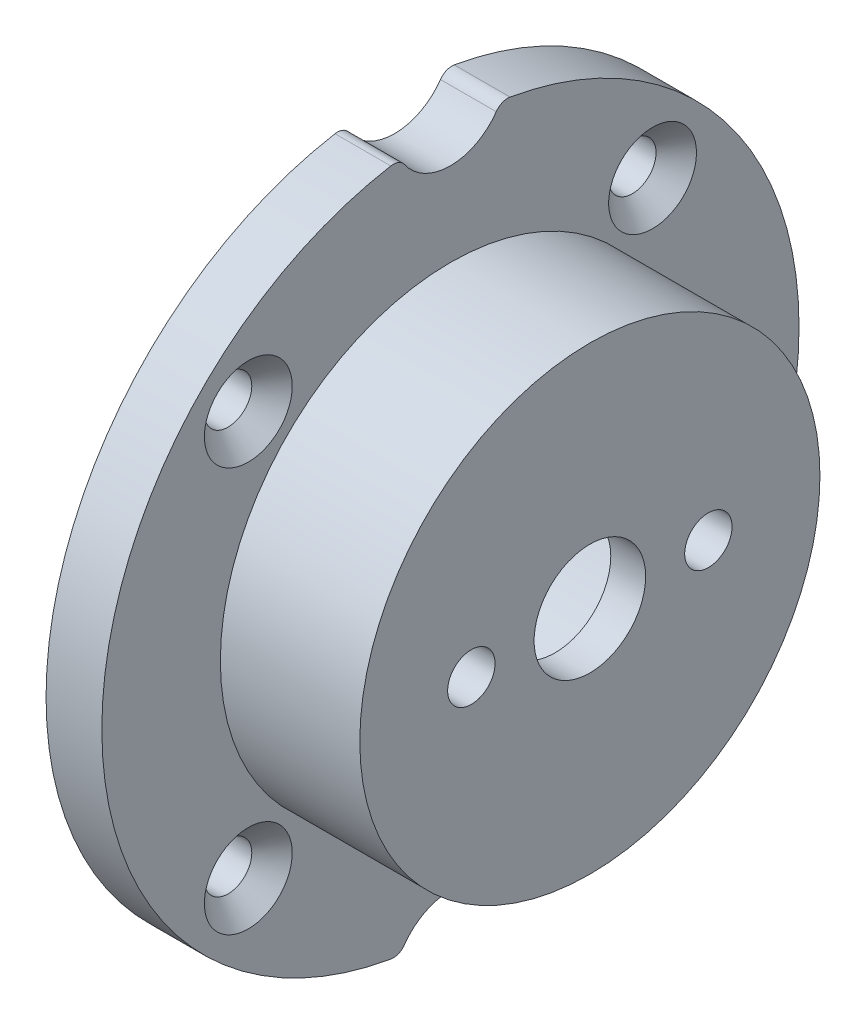
ISO-10303-21;
HEADER;
FILE_DESCRIPTION(('STEP AP214'),'2;1');
FILE_NAME('part.step','',(''),(''),'','','');
FILE_SCHEMA(('AUTOMOTIVE_DESIGN { 1 0 10303 214 1 1 1 1 }'));
ENDSEC;
DATA;
#1=APPLICATION_CONTEXT('core data for automotive mechanical design processes');
#2=APPLICATION_PROTOCOL_DEFINITION('international standard','automotive_design',2000,#1);
#3=PRODUCT_CONTEXT('',#1,'mechanical');
#4=PRODUCT('Part','Part','',(#3));
#5=PRODUCT_RELATED_PRODUCT_CATEGORY('part','',(#4));
#6=PRODUCT_DEFINITION_FORMATION('','',#4);
#7=PRODUCT_DEFINITION_CONTEXT('part definition',#1,'design');
#8=PRODUCT_DEFINITION('design','',#6,#7);
#9=PRODUCT_DEFINITION_SHAPE('','',#8);
#10=(LENGTH_UNIT() NAMED_UNIT(*) SI_UNIT(.MILLI.,.METRE.));
#11=(NAMED_UNIT(*) PLANE_ANGLE_UNIT() SI_UNIT($,.RADIAN.));
#12=(NAMED_UNIT(*) SI_UNIT($,.STERADIAN.) SOLID_ANGLE_UNIT());
#13=UNCERTAINTY_MEASURE_WITH_UNIT(LENGTH_MEASURE(1.E-05),#10,'distance_accuracy_value','');
#14=(GEOMETRIC_REPRESENTATION_CONTEXT(3) GLOBAL_UNCERTAINTY_ASSIGNED_CONTEXT((#13)) GLOBAL_UNIT_ASSIGNED_CONTEXT((#10,
#11,#12)) REPRESENTATION_CONTEXT('',''));
#15=CARTESIAN_POINT('',(0.,0.,0.));
#16=DIRECTION('',(0.,0.,1.));
#17=DIRECTION('',(1.,0.,0.));
#18=AXIS2_PLACEMENT_3D('',#15,#16,#17);
#19=CARTESIAN_POINT('',(4.,0.,0.));
#20=DIRECTION('',(-1.,0.,0.));
#21=DIRECTION('',(0.,0.,1.));
#22=AXIS2_PLACEMENT_3D('',#19,#20,#21);
#23=CYLINDRICAL_SURFACE('',#22,25.);
#24=CARTESIAN_POINT('',(0.,0.,0.));
#25=DIRECTION('',(1.,0.,0.));
#26=DIRECTION('',(0.,0.,-1.));
#27=AXIS2_PLACEMENT_3D('',#24,#25,#26);
#28=CIRCLE('',#27,25.);
#29=CARTESIAN_POINT('',(0.,24.6314858490566,4.27666983384552));
#30=VERTEX_POINT('',#29);
#31=CARTESIAN_POINT('',(0.,-24.6314858490566,4.27666983384552));
#32=VERTEX_POINT('',#31);
#33=EDGE_CURVE('E114',#30,#32,#28,.T.);
#34=ORIENTED_EDGE('',*,*,#33,.T.);
#35=DIRECTION('',(-1.,0.,0.));
#36=VECTOR('',#35,1.);
#37=CARTESIAN_POINT('',(4.,-24.6314858490566,4.27666983384552));
#38=LINE('',#37,#36);
#39=CARTESIAN_POINT('',(4.,-24.6314858490566,4.27666983384552));
#40=VERTEX_POINT('',#39);
#41=EDGE_CURVE('E118',#32,#40,#38,.F.);
#42=ORIENTED_EDGE('',*,*,#41,.T.);
#43=CARTESIAN_POINT('',(4.,0.,0.));
#44=DIRECTION('',(1.,0.,0.));
#45=DIRECTION('',(0.,0.,-1.));
#46=AXIS2_PLACEMENT_3D('',#43,#44,#45);
#47=CIRCLE('',#46,25.);
#48=CARTESIAN_POINT('',(4.,24.6314858490566,4.27666983384552));
#49=VERTEX_POINT('',#48);
#50=EDGE_CURVE('E117',#49,#40,#47,.T.);
#51=ORIENTED_EDGE('',*,*,#50,.F.);
#52=DIRECTION('',(-1.,0.,0.));
#53=VECTOR('',#52,1.);
#54=CARTESIAN_POINT('',(4.,24.6314858490566,4.27666983384552));
#55=LINE('',#54,#53);
#56=EDGE_CURVE('E106',#49,#30,#55,.T.);
#57=ORIENTED_EDGE('',*,*,#56,.T.);
#58=EDGE_LOOP('',(#34,#42,#51,#57));
#59=FACE_BOUND('',#58,.T.);
#60=ADVANCED_FACE('F39',(#59),#23,.T.);
#61=CARTESIAN_POINT('',(4.,0.,0.));
#62=DIRECTION('',(1.,0.,0.));
#63=DIRECTION('',(0.,0.,-1.));
#64=AXIS2_PLACEMENT_3D('',#61,#62,#63);
#65=PLANE('',#64);
#66=ORIENTED_EDGE('',*,*,#50,.T.);
#67=CARTESIAN_POINT('',(4.,-23.6462264150943,4.1056030404917));
#68=DIRECTION('',(1.,0.,0.));
#69=DIRECTION('',(0.,0.,-1.));
#70=AXIS2_PLACEMENT_3D('',#67,#68,#69);
#71=CIRCLE('',#70,1.);
#72=CARTESIAN_POINT('',(4.,-24.2169811320755,3.28448243239336));
#73=VERTEX_POINT('',#72);
#74=EDGE_CURVE('E157',#40,#73,#71,.T.);
#75=ORIENTED_EDGE('',*,*,#74,.T.);
#76=CARTESIAN_POINT('',(4.,-26.5,0.));
#77=DIRECTION('',(1.,0.,0.));
#78=DIRECTION('',(0.,0.,1.));
#79=AXIS2_PLACEMENT_3D('',#76,#77,#78);
#80=CIRCLE('',#79,4.);
#81=CARTESIAN_POINT('',(4.,-24.2169811320755,-3.28448243239336));
#82=VERTEX_POINT('',#81);
#83=EDGE_CURVE('E188',#82,#73,#80,.T.);
#84=ORIENTED_EDGE('',*,*,#83,.F.);
#85=CARTESIAN_POINT('',(4.,-23.6462264150943,-4.1056030404917));
#86=DIRECTION('',(1.,0.,0.));
#87=DIRECTION('',(0.,0.,-1.));
#88=AXIS2_PLACEMENT_3D('',#85,#86,#87);
#89=CIRCLE('',#88,1.);
#90=CARTESIAN_POINT('',(4.,-24.6314858490566,-4.27666983384552));
#91=VERTEX_POINT('',#90);
#92=EDGE_CURVE('E155',#82,#91,#89,.T.);
#93=ORIENTED_EDGE('',*,*,#92,.T.);
#94=CARTESIAN_POINT('',(4.,24.6314858490566,-4.27666983384552));
#95=VERTEX_POINT('',#94);
#96=EDGE_CURVE('E125',#91,#95,#47,.T.);
#97=ORIENTED_EDGE('',*,*,#96,.T.);
#98=CARTESIAN_POINT('',(4.,23.6462264150943,-4.1056030404917));
#99=DIRECTION('',(1.,0.,0.));
#100=DIRECTION('',(0.,0.,-1.));
#101=AXIS2_PLACEMENT_3D('',#98,#99,#100);
#102=CIRCLE('',#101,1.);
#103=CARTESIAN_POINT('',(4.,24.2169811320755,-3.28448243239336));
#104=VERTEX_POINT('',#103);
#105=EDGE_CURVE('E151',#95,#104,#102,.T.);
#106=ORIENTED_EDGE('',*,*,#105,.T.);
#107=CARTESIAN_POINT('',(4.,26.5,0.));
#108=DIRECTION('',(1.,0.,0.));
#109=DIRECTION('',(0.,0.,-1.));
#110=AXIS2_PLACEMENT_3D('',#107,#108,#109);
#111=CIRCLE('',#110,4.);
#112=CARTESIAN_POINT('',(4.,24.2169811320755,3.28448243239336));
#113=VERTEX_POINT('',#112);
#114=EDGE_CURVE('E196',#113,#104,#111,.T.);
#115=ORIENTED_EDGE('',*,*,#114,.F.);
#116=CARTESIAN_POINT('',(4.,23.6462264150943,4.1056030404917));
#117=DIRECTION('',(1.,0.,0.));
#118=DIRECTION('',(0.,0.,-1.));
#119=AXIS2_PLACEMENT_3D('',#116,#117,#118);
#120=CIRCLE('',#119,1.);
#121=EDGE_CURVE('E153',#113,#49,#120,.T.);
#122=ORIENTED_EDGE('',*,*,#121,.T.);
#123=EDGE_LOOP('',(#66,#75,#84,#93,#97,#106,#115,#122));
#124=FACE_BOUND('',#123,.T.);
#125=CARTESIAN_POINT('',(4.,14.4956890143241,14.4956890143244));
#126=DIRECTION('',(1.,0.,0.));
#127=DIRECTION('',(0.,0.,-1.));
#128=AXIS2_PLACEMENT_3D('',#125,#126,#127);
#129=CIRCLE('',#128,3.15);
#130=CARTESIAN_POINT('',(4.,14.4956890143241,11.3456890143244));
#131=VERTEX_POINT('',#130);
#132=EDGE_CURVE('E206',#131,#131,#129,.T.);
#133=ORIENTED_EDGE('',*,*,#132,.F.);
#134=EDGE_LOOP('',(#133));
#135=FACE_BOUND('',#134,.T.);
#136=CARTESIAN_POINT('',(4.,14.4956890143242,-14.4956890143242));
#137=DIRECTION('',(1.,0.,0.));
#138=DIRECTION('',(0.,0.,-1.));
#139=AXIS2_PLACEMENT_3D('',#136,#137,#138);
#140=CIRCLE('',#139,3.15);
#141=CARTESIAN_POINT('',(4.,14.4956890143242,-17.6456890143242));
#142=VERTEX_POINT('',#141);
#143=EDGE_CURVE('E215',#142,#142,#140,.T.);
#144=ORIENTED_EDGE('',*,*,#143,.F.);
#145=EDGE_LOOP('',(#144));
#146=FACE_BOUND('',#145,.T.);
#147=CARTESIAN_POINT('',(4.,-14.4956890143242,-14.4956890143243));
#148=DIRECTION('',(1.,0.,0.));
#149=DIRECTION('',(0.,0.,-1.));
#150=AXIS2_PLACEMENT_3D('',#147,#148,#149);
#151=CIRCLE('',#150,3.15);
#152=CARTESIAN_POINT('',(4.,-14.4956890143242,-17.6456890143243));
#153=VERTEX_POINT('',#152);
#154=EDGE_CURVE('E224',#153,#153,#151,.T.);
#155=ORIENTED_EDGE('',*,*,#154,.F.);
#156=EDGE_LOOP('',(#155));
#157=FACE_BOUND('',#156,.T.);
#158=CARTESIAN_POINT('',(4.,-14.4956890143242,14.4956890143242));
#159=DIRECTION('',(1.,0.,0.));
#160=DIRECTION('',(0.,0.,-1.));
#161=AXIS2_PLACEMENT_3D('',#158,#159,#160);
#162=CIRCLE('',#161,3.15);
#163=CARTESIAN_POINT('',(4.,-14.4956890143242,11.3456890143242));
#164=VERTEX_POINT('',#163);
#165=EDGE_CURVE('E233',#164,#164,#162,.T.);
#166=ORIENTED_EDGE('',*,*,#165,.F.);
#167=EDGE_LOOP('',(#166));
#168=FACE_BOUND('',#167,.T.);
#169=CARTESIAN_POINT('',(4.,0.,0.));
#170=DIRECTION('',(1.,0.,0.));
#171=DIRECTION('',(0.,0.,-1.));
#172=AXIS2_PLACEMENT_3D('',#169,#170,#171);
#173=CIRCLE('',#172,16.5);
#174=CARTESIAN_POINT('',(4.,0.,-16.5));
#175=VERTEX_POINT('',#174);
#176=EDGE_CURVE('E137',#175,#175,#173,.T.);
#177=ORIENTED_EDGE('',*,*,#176,.F.);
#178=EDGE_LOOP('',(#177));
#179=FACE_BOUND('',#178,.T.);
#180=ADVANCED_FACE('F183',(#124,#135,#146,#157,#168,#179),#65,.T.);
#181=ORIENTED_EDGE('',*,*,#96,.F.);
#182=DIRECTION('',(-1.,0.,0.));
#183=VECTOR('',#182,1.);
#184=CARTESIAN_POINT('',(4.,-24.6314858490566,-4.27666983384552));
#185=LINE('',#184,#183);
#186=CARTESIAN_POINT('',(0.,-24.6314858490566,-4.27666983384552));
#187=VERTEX_POINT('',#186);
#188=EDGE_CURVE('E169',#91,#187,#185,.T.);
#189=ORIENTED_EDGE('',*,*,#188,.T.);
#190=CARTESIAN_POINT('',(0.,24.6314858490566,-4.27666983384552));
#191=VERTEX_POINT('',#190);
#192=EDGE_CURVE('E126',#187,#191,#28,.T.);
#193=ORIENTED_EDGE('',*,*,#192,.T.);
#194=DIRECTION('',(-1.,0.,0.));
#195=VECTOR('',#194,1.);
#196=CARTESIAN_POINT('',(4.,24.6314858490566,-4.27666983384552));
#197=LINE('',#196,#195);
#198=EDGE_CURVE('E166',#191,#95,#197,.F.);
#199=ORIENTED_EDGE('',*,*,#198,.T.);
#200=EDGE_LOOP('',(#181,#189,#193,#199));
#201=FACE_BOUND('',#200,.T.);
#202=ADVANCED_FACE('F175',(#201),#23,.T.);
#203=CARTESIAN_POINT('',(0.,0.,0.));
#204=DIRECTION('',(1.,0.,0.));
#205=DIRECTION('',(0.,0.,-1.));
#206=AXIS2_PLACEMENT_3D('',#203,#204,#205);
#207=PLANE('',#206);
#208=CARTESIAN_POINT('',(0.,0.,0.));
#209=DIRECTION('',(-1.,0.,0.));
#210=DIRECTION('',(0.,0.,1.));
#211=AXIS2_PLACEMENT_3D('',#208,#209,#210);
#212=CIRCLE('',#211,13.125);
#213=CARTESIAN_POINT('',(0.,0.,13.125));
#214=VERTEX_POINT('',#213);
#215=EDGE_CURVE('E197',#214,#214,#212,.T.);
#216=ORIENTED_EDGE('',*,*,#215,.F.);
#217=EDGE_LOOP('',(#216));
#218=FACE_BOUND('',#217,.T.);
#219=CARTESIAN_POINT('',(0.,14.4956890143241,14.4956890143244));
#220=DIRECTION('',(1.,0.,0.));
#221=DIRECTION('',(0.,0.,-1.));
#222=AXIS2_PLACEMENT_3D('',#219,#220,#221);
#223=CIRCLE('',#222,1.7);
#224=CARTESIAN_POINT('',(0.,14.4956890143241,12.7956890143244));
#225=VERTEX_POINT('',#224);
#226=EDGE_CURVE('E212',#225,#225,#223,.T.);
#227=ORIENTED_EDGE('',*,*,#226,.T.);
#228=EDGE_LOOP('',(#227));
#229=FACE_BOUND('',#228,.T.);
#230=CARTESIAN_POINT('',(0.,14.4956890143242,-14.4956890143242));
#231=DIRECTION('',(1.,0.,0.));
#232=DIRECTION('',(0.,0.,-1.));
#233=AXIS2_PLACEMENT_3D('',#230,#231,#232);
#234=CIRCLE('',#233,1.7);
#235=CARTESIAN_POINT('',(0.,14.4956890143242,-16.1956890143242));
#236=VERTEX_POINT('',#235);
#237=EDGE_CURVE('E221',#236,#236,#234,.T.);
#238=ORIENTED_EDGE('',*,*,#237,.T.);
#239=EDGE_LOOP('',(#238));
#240=FACE_BOUND('',#239,.T.);
#241=CARTESIAN_POINT('',(0.,-14.4956890143242,-14.4956890143243));
#242=DIRECTION('',(1.,0.,0.));
#243=DIRECTION('',(0.,0.,-1.));
#244=AXIS2_PLACEMENT_3D('',#241,#242,#243);
#245=CIRCLE('',#244,1.7);
#246=CARTESIAN_POINT('',(0.,-14.4956890143242,-16.1956890143243));
#247=VERTEX_POINT('',#246);
#248=EDGE_CURVE('E230',#247,#247,#245,.T.);
#249=ORIENTED_EDGE('',*,*,#248,.T.);
#250=EDGE_LOOP('',(#249));
#251=FACE_BOUND('',#250,.T.);
#252=CARTESIAN_POINT('',(0.,-14.4956890143242,14.4956890143242));
#253=DIRECTION('',(1.,0.,0.));
#254=DIRECTION('',(0.,0.,-1.));
#255=AXIS2_PLACEMENT_3D('',#252,#253,#254);
#256=CIRCLE('',#255,1.7);
#257=CARTESIAN_POINT('',(0.,-14.4956890143242,12.7956890143242));
#258=VERTEX_POINT('',#257);
#259=EDGE_CURVE('E239',#258,#258,#256,.T.);
#260=ORIENTED_EDGE('',*,*,#259,.T.);
#261=EDGE_LOOP('',(#260));
#262=FACE_BOUND('',#261,.T.);
#263=CARTESIAN_POINT('',(0.,-26.5,0.));
#264=DIRECTION('',(1.,0.,0.));
#265=DIRECTION('',(0.,0.,-1.));
#266=AXIS2_PLACEMENT_3D('',#263,#264,#265);
#267=CIRCLE('',#266,4.);
#268=CARTESIAN_POINT('',(0.,-24.2169811320755,-3.28448243239336));
#269=VERTEX_POINT('',#268);
#270=CARTESIAN_POINT('',(0.,-24.2169811320755,3.28448243239336));
#271=VERTEX_POINT('',#270);
#272=EDGE_CURVE('E119',#269,#271,#267,.T.);
#273=ORIENTED_EDGE('',*,*,#272,.T.);
#274=CARTESIAN_POINT('',(0.,-23.6462264150943,4.1056030404917));
#275=DIRECTION('',(1.,0.,0.));
#276=DIRECTION('',(0.,0.,-1.));
#277=AXIS2_PLACEMENT_3D('',#274,#275,#276);
#278=CIRCLE('',#277,1.);
#279=EDGE_CURVE('E124',#271,#32,#278,.F.);
#280=ORIENTED_EDGE('',*,*,#279,.T.);
#281=ORIENTED_EDGE('',*,*,#33,.F.);
#282=CARTESIAN_POINT('',(0.,23.6462264150943,4.1056030404917));
#283=DIRECTION('',(1.,0.,0.));
#284=DIRECTION('',(0.,0.,-1.));
#285=AXIS2_PLACEMENT_3D('',#282,#283,#284);
#286=CIRCLE('',#285,1.);
#287=CARTESIAN_POINT('',(0.,24.2169811320755,3.28448243239336));
#288=VERTEX_POINT('',#287);
#289=EDGE_CURVE('E60',#30,#288,#286,.F.);
#290=ORIENTED_EDGE('',*,*,#289,.T.);
#291=CARTESIAN_POINT('',(0.,26.5,0.));
#292=DIRECTION('',(1.,0.,0.));
#293=DIRECTION('',(0.,0.,-1.));
#294=AXIS2_PLACEMENT_3D('',#291,#292,#293);
#295=CIRCLE('',#294,4.);
#296=CARTESIAN_POINT('',(0.,24.2169811320755,-3.28448243239336));
#297=VERTEX_POINT('',#296);
#298=EDGE_CURVE('E147',#288,#297,#295,.T.);
#299=ORIENTED_EDGE('',*,*,#298,.T.);
#300=CARTESIAN_POINT('',(0.,23.6462264150943,-4.1056030404917));
#301=DIRECTION('',(1.,0.,0.));
#302=DIRECTION('',(0.,0.,-1.));
#303=AXIS2_PLACEMENT_3D('',#300,#301,#302);
#304=CIRCLE('',#303,1.);
#305=EDGE_CURVE('E108',#297,#191,#304,.F.);
#306=ORIENTED_EDGE('',*,*,#305,.T.);
#307=ORIENTED_EDGE('',*,*,#192,.F.);
#308=CARTESIAN_POINT('',(0.,-23.6462264150943,-4.1056030404917));
#309=DIRECTION('',(1.,0.,0.));
#310=DIRECTION('',(0.,0.,-1.));
#311=AXIS2_PLACEMENT_3D('',#308,#309,#310);
#312=CIRCLE('',#311,1.);
#313=EDGE_CURVE('E107',#187,#269,#312,.F.);
#314=ORIENTED_EDGE('',*,*,#313,.T.);
#315=EDGE_LOOP('',(#273,#280,#281,#290,#299,#306,#307,#314));
#316=FACE_BOUND('',#315,.T.);
#317=ADVANCED_FACE('F122',(#218,#229,#240,#251,#262,#316),#207,.F.);
#318=CARTESIAN_POINT('',(14.,0.,0.));
#319=DIRECTION('',(-1.,0.,0.));
#320=DIRECTION('',(0.,0.,1.));
#321=AXIS2_PLACEMENT_3D('',#318,#319,#320);
#322=CYLINDRICAL_SURFACE('',#321,16.5);
#323=CARTESIAN_POINT('',(14.,0.,0.));
#324=DIRECTION('',(1.,0.,0.));
#325=DIRECTION('',(0.,0.,-1.));
#326=AXIS2_PLACEMENT_3D('',#323,#324,#325);
#327=CIRCLE('',#326,16.5);
#328=CARTESIAN_POINT('',(14.,0.,-16.5));
#329=VERTEX_POINT('',#328);
#330=EDGE_CURVE('E131',#329,#329,#327,.T.);
#331=ORIENTED_EDGE('',*,*,#330,.F.);
#332=EDGE_LOOP('',(#331));
#333=FACE_BOUND('',#332,.T.);
#334=ORIENTED_EDGE('',*,*,#176,.T.);
#335=EDGE_LOOP('',(#334));
#336=FACE_BOUND('',#335,.T.);
#337=ADVANCED_FACE('F252',(#333,#336),#322,.T.);
#338=CARTESIAN_POINT('',(14.,0.,0.));
#339=DIRECTION('',(1.,0.,0.));
#340=DIRECTION('',(0.,0.,-1.));
#341=AXIS2_PLACEMENT_3D('',#338,#339,#340);
#342=PLANE('',#341);
#343=CARTESIAN_POINT('',(14.,0.,-8.5));
#344=DIRECTION('',(1.,0.,0.));
#345=DIRECTION('',(0.,0.,-1.));
#346=AXIS2_PLACEMENT_3D('',#343,#344,#345);
#347=CIRCLE('',#346,1.69999999999999);
#348=CARTESIAN_POINT('',(14.,0.,-10.2));
#349=VERTEX_POINT('',#348);
#350=EDGE_CURVE('E146',#349,#349,#347,.T.);
#351=ORIENTED_EDGE('',*,*,#350,.F.);
#352=EDGE_LOOP('',(#351));
#353=FACE_BOUND('',#352,.T.);
#354=CARTESIAN_POINT('',(14.,0.,8.5));
#355=DIRECTION('',(1.,0.,0.));
#356=DIRECTION('',(0.,0.,-1.));
#357=AXIS2_PLACEMENT_3D('',#354,#355,#356);
#358=CIRCLE('',#357,1.69999999999999);
#359=CARTESIAN_POINT('',(14.,0.,6.80000000000001));
#360=VERTEX_POINT('',#359);
#361=EDGE_CURVE('E142',#360,#360,#358,.T.);
#362=ORIENTED_EDGE('',*,*,#361,.F.);
#363=EDGE_LOOP('',(#362));
#364=FACE_BOUND('',#363,.T.);
#365=CARTESIAN_POINT('',(14.,0.,0.));
#366=DIRECTION('',(1.,0.,0.));
#367=DIRECTION('',(0.,0.,-1.));
#368=AXIS2_PLACEMENT_3D('',#365,#366,#367);
#369=CIRCLE('',#368,4.);
#370=CARTESIAN_POINT('',(14.,0.,-4.));
#371=VERTEX_POINT('',#370);
#372=EDGE_CURVE('E138',#371,#371,#369,.T.);
#373=ORIENTED_EDGE('',*,*,#372,.F.);
#374=EDGE_LOOP('',(#373));
#375=FACE_BOUND('',#374,.T.);
#376=ORIENTED_EDGE('',*,*,#330,.T.);
#377=EDGE_LOOP('',(#376));
#378=FACE_BOUND('',#377,.T.);
#379=ADVANCED_FACE('F356',(#353,#364,#375,#378),#342,.T.);
#380=CARTESIAN_POINT('',(11.5,0.,0.));
#381=DIRECTION('',(1.,0.,0.));
#382=DIRECTION('',(0.,0.,-1.));
#383=AXIS2_PLACEMENT_3D('',#380,#381,#382);
#384=PLANE('',#383);
#385=CARTESIAN_POINT('',(11.5,0.,-8.5));
#386=DIRECTION('',(1.,0.,0.));
#387=DIRECTION('',(0.,0.,-1.));
#388=AXIS2_PLACEMENT_3D('',#385,#386,#387);
#389=CIRCLE('',#388,1.69999999999999);
#390=CARTESIAN_POINT('',(11.5,0.,-10.2));
#391=VERTEX_POINT('',#390);
#392=EDGE_CURVE('E143',#391,#391,#389,.T.);
#393=ORIENTED_EDGE('',*,*,#392,.T.);
#394=EDGE_LOOP('',(#393));
#395=FACE_BOUND('',#394,.T.);
#396=CARTESIAN_POINT('',(11.5,0.,8.5));
#397=DIRECTION('',(1.,0.,0.));
#398=DIRECTION('',(0.,0.,-1.));
#399=AXIS2_PLACEMENT_3D('',#396,#397,#398);
#400=CIRCLE('',#399,1.69999999999999);
#401=CARTESIAN_POINT('',(11.5,0.,6.80000000000001));
#402=VERTEX_POINT('',#401);
#403=EDGE_CURVE('E139',#402,#402,#400,.T.);
#404=ORIENTED_EDGE('',*,*,#403,.T.);
#405=EDGE_LOOP('',(#404));
#406=FACE_BOUND('',#405,.T.);
#407=CARTESIAN_POINT('',(11.5,0.,0.));
#408=DIRECTION('',(1.,0.,0.));
#409=DIRECTION('',(0.,0.,-1.));
#410=AXIS2_PLACEMENT_3D('',#407,#408,#409);
#411=CIRCLE('',#410,4.);
#412=CARTESIAN_POINT('',(11.5,0.,-4.));
#413=VERTEX_POINT('',#412);
#414=EDGE_CURVE('E134',#413,#413,#411,.T.);
#415=ORIENTED_EDGE('',*,*,#414,.T.);
#416=EDGE_LOOP('',(#415));
#417=FACE_BOUND('',#416,.T.);
#418=CARTESIAN_POINT('',(11.5,0.,0.));
#419=DIRECTION('',(1.,0.,0.));
#420=DIRECTION('',(0.,0.,-1.));
#421=AXIS2_PLACEMENT_3D('',#418,#419,#420);
#422=CIRCLE('',#421,13.125);
#423=CARTESIAN_POINT('',(11.5,0.,-13.125));
#424=VERTEX_POINT('',#423);
#425=EDGE_CURVE('E200',#424,#424,#422,.F.);
#426=ORIENTED_EDGE('',*,*,#425,.T.);
#427=EDGE_LOOP('',(#426));
#428=FACE_BOUND('',#427,.T.);
#429=ADVANCED_FACE('F351',(#395,#406,#417,#428),#384,.F.);
#430=CARTESIAN_POINT('',(10.,0.,0.));
#431=DIRECTION('',(1.,0.,0.));
#432=DIRECTION('',(0.,0.,-1.));
#433=AXIS2_PLACEMENT_3D('',#430,#431,#432);
#434=CYLINDRICAL_SURFACE('',#433,4.);
#435=ORIENTED_EDGE('',*,*,#372,.T.);
#436=EDGE_LOOP('',(#435));
#437=FACE_BOUND('',#436,.T.);
#438=ORIENTED_EDGE('',*,*,#414,.F.);
#439=EDGE_LOOP('',(#438));
#440=FACE_BOUND('',#439,.T.);
#441=ADVANCED_FACE('F355',(#437,#440),#434,.F.);
#442=CARTESIAN_POINT('',(14.,0.,8.5));
#443=DIRECTION('',(1.,0.,0.));
#444=DIRECTION('',(0.,0.,-1.));
#445=AXIS2_PLACEMENT_3D('',#442,#443,#444);
#446=CYLINDRICAL_SURFACE('',#445,1.69999999999999);
#447=ORIENTED_EDGE('',*,*,#361,.T.);
#448=EDGE_LOOP('',(#447));
#449=FACE_BOUND('',#448,.T.);
#450=ORIENTED_EDGE('',*,*,#403,.F.);
#451=EDGE_LOOP('',(#450));
#452=FACE_BOUND('',#451,.T.);
#453=ADVANCED_FACE('F448',(#449,#452),#446,.F.);
#454=CARTESIAN_POINT('',(14.,0.,-8.5));
#455=DIRECTION('',(1.,0.,0.));
#456=DIRECTION('',(0.,0.,-1.));
#457=AXIS2_PLACEMENT_3D('',#454,#455,#456);
#458=CYLINDRICAL_SURFACE('',#457,1.69999999999999);
#459=ORIENTED_EDGE('',*,*,#350,.T.);
#460=EDGE_LOOP('',(#459));
#461=FACE_BOUND('',#460,.T.);
#462=ORIENTED_EDGE('',*,*,#392,.F.);
#463=EDGE_LOOP('',(#462));
#464=FACE_BOUND('',#463,.T.);
#465=ADVANCED_FACE('F438',(#461,#464),#458,.F.);
#466=CARTESIAN_POINT('',(4.,-14.4956890143242,14.4956890143242));
#467=DIRECTION('',(1.,0.,0.));
#468=DIRECTION('',(0.,0.,-1.));
#469=AXIS2_PLACEMENT_3D('',#466,#467,#468);
#470=CYLINDRICAL_SURFACE('',#469,1.7);
#471=ORIENTED_EDGE('',*,*,#259,.F.);
#472=EDGE_LOOP('',(#471));
#473=FACE_BOUND('',#472,.T.);
#474=CARTESIAN_POINT('',(2.55,-14.4956890143242,14.4956890143242));
#475=DIRECTION('',(1.,0.,0.));
#476=DIRECTION('',(0.,0.,-1.));
#477=AXIS2_PLACEMENT_3D('',#474,#475,#476);
#478=CIRCLE('',#477,1.7);
#479=CARTESIAN_POINT('',(2.55,-14.4956890143242,12.7956890143242));
#480=VERTEX_POINT('',#479);
#481=EDGE_CURVE('E236',#480,#480,#478,.T.);
#482=ORIENTED_EDGE('',*,*,#481,.T.);
#483=EDGE_LOOP('',(#482));
#484=FACE_BOUND('',#483,.T.);
#485=ADVANCED_FACE('F428',(#473,#484),#470,.F.);
#486=CARTESIAN_POINT('',(4.,-14.4956890143242,14.4956890143242));
#487=DIRECTION('',(1.,0.,0.));
#488=DIRECTION('',(0.,0.,-1.));
#489=AXIS2_PLACEMENT_3D('',#486,#487,#488);
#490=CONICAL_SURFACE('',#489,3.15,0.785398163397449);
#491=ORIENTED_EDGE('',*,*,#481,.F.);
#492=EDGE_LOOP('',(#491));
#493=FACE_BOUND('',#492,.T.);
#494=ORIENTED_EDGE('',*,*,#165,.T.);
#495=EDGE_LOOP('',(#494));
#496=FACE_BOUND('',#495,.T.);
#497=ADVANCED_FACE('F418',(#493,#496),#490,.F.);
#498=CARTESIAN_POINT('',(4.,-14.4956890143242,-14.4956890143243));
#499=DIRECTION('',(1.,0.,0.));
#500=DIRECTION('',(0.,0.,-1.));
#501=AXIS2_PLACEMENT_3D('',#498,#499,#500);
#502=CYLINDRICAL_SURFACE('',#501,1.7);
#503=ORIENTED_EDGE('',*,*,#248,.F.);
#504=EDGE_LOOP('',(#503));
#505=FACE_BOUND('',#504,.T.);
#506=CARTESIAN_POINT('',(2.55,-14.4956890143242,-14.4956890143243));
#507=DIRECTION('',(1.,0.,0.));
#508=DIRECTION('',(0.,0.,-1.));
#509=AXIS2_PLACEMENT_3D('',#506,#507,#508);
#510=CIRCLE('',#509,1.7);
#511=CARTESIAN_POINT('',(2.55,-14.4956890143242,-16.1956890143243));
#512=VERTEX_POINT('',#511);
#513=EDGE_CURVE('E227',#512,#512,#510,.T.);
#514=ORIENTED_EDGE('',*,*,#513,.T.);
#515=EDGE_LOOP('',(#514));
#516=FACE_BOUND('',#515,.T.);
#517=ADVANCED_FACE('F408',(#505,#516),#502,.F.);
#518=CARTESIAN_POINT('',(4.,-14.4956890143242,-14.4956890143243));
#519=DIRECTION('',(1.,0.,0.));
#520=DIRECTION('',(0.,0.,-1.));
#521=AXIS2_PLACEMENT_3D('',#518,#519,#520);
#522=CONICAL_SURFACE('',#521,3.15,0.785398163397448);
#523=ORIENTED_EDGE('',*,*,#513,.F.);
#524=EDGE_LOOP('',(#523));
#525=FACE_BOUND('',#524,.T.);
#526=ORIENTED_EDGE('',*,*,#154,.T.);
#527=EDGE_LOOP('',(#526));
#528=FACE_BOUND('',#527,.T.);
#529=ADVANCED_FACE('F398',(#525,#528),#522,.F.);
#530=CARTESIAN_POINT('',(4.,14.4956890143242,-14.4956890143242));
#531=DIRECTION('',(1.,0.,0.));
#532=DIRECTION('',(0.,0.,-1.));
#533=AXIS2_PLACEMENT_3D('',#530,#531,#532);
#534=CYLINDRICAL_SURFACE('',#533,1.7);
#535=ORIENTED_EDGE('',*,*,#237,.F.);
#536=EDGE_LOOP('',(#535));
#537=FACE_BOUND('',#536,.T.);
#538=CARTESIAN_POINT('',(2.55,14.4956890143242,-14.4956890143242));
#539=DIRECTION('',(1.,0.,0.));
#540=DIRECTION('',(0.,0.,-1.));
#541=AXIS2_PLACEMENT_3D('',#538,#539,#540);
#542=CIRCLE('',#541,1.7);
#543=CARTESIAN_POINT('',(2.55,14.4956890143242,-16.1956890143242));
#544=VERTEX_POINT('',#543);
#545=EDGE_CURVE('E218',#544,#544,#542,.T.);
#546=ORIENTED_EDGE('',*,*,#545,.T.);
#547=EDGE_LOOP('',(#546));
#548=FACE_BOUND('',#547,.T.);
#549=ADVANCED_FACE('F388',(#537,#548),#534,.F.);
#550=CARTESIAN_POINT('',(4.,14.4956890143242,-14.4956890143242));
#551=DIRECTION('',(1.,0.,0.));
#552=DIRECTION('',(0.,0.,-1.));
#553=AXIS2_PLACEMENT_3D('',#550,#551,#552);
#554=CONICAL_SURFACE('',#553,3.15,0.785398163397448);
#555=ORIENTED_EDGE('',*,*,#545,.F.);
#556=EDGE_LOOP('',(#555));
#557=FACE_BOUND('',#556,.T.);
#558=ORIENTED_EDGE('',*,*,#143,.T.);
#559=EDGE_LOOP('',(#558));
#560=FACE_BOUND('',#559,.T.);
#561=ADVANCED_FACE('F378',(#557,#560),#554,.F.);
#562=CARTESIAN_POINT('',(4.,14.4956890143241,14.4956890143244));
#563=DIRECTION('',(1.,0.,0.));
#564=DIRECTION('',(0.,0.,-1.));
#565=AXIS2_PLACEMENT_3D('',#562,#563,#564);
#566=CYLINDRICAL_SURFACE('',#565,1.7);
#567=ORIENTED_EDGE('',*,*,#226,.F.);
#568=EDGE_LOOP('',(#567));
#569=FACE_BOUND('',#568,.T.);
#570=CARTESIAN_POINT('',(2.55,14.4956890143241,14.4956890143244));
#571=DIRECTION('',(1.,0.,0.));
#572=DIRECTION('',(0.,0.,-1.));
#573=AXIS2_PLACEMENT_3D('',#570,#571,#572);
#574=CIRCLE('',#573,1.7);
#575=CARTESIAN_POINT('',(2.55,14.4956890143241,12.7956890143244));
#576=VERTEX_POINT('',#575);
#577=EDGE_CURVE('E209',#576,#576,#574,.T.);
#578=ORIENTED_EDGE('',*,*,#577,.T.);
#579=EDGE_LOOP('',(#578));
#580=FACE_BOUND('',#579,.T.);
#581=ADVANCED_FACE('F368',(#569,#580),#566,.F.);
#582=CARTESIAN_POINT('',(4.,14.4956890143241,14.4956890143244));
#583=DIRECTION('',(1.,0.,0.));
#584=DIRECTION('',(0.,0.,-1.));
#585=AXIS2_PLACEMENT_3D('',#582,#583,#584);
#586=CONICAL_SURFACE('',#585,3.15,0.785398163397448);
#587=ORIENTED_EDGE('',*,*,#577,.F.);
#588=EDGE_LOOP('',(#587));
#589=FACE_BOUND('',#588,.T.);
#590=ORIENTED_EDGE('',*,*,#132,.T.);
#591=EDGE_LOOP('',(#590));
#592=FACE_BOUND('',#591,.T.);
#593=ADVANCED_FACE('F343',(#589,#592),#586,.F.);
#594=CARTESIAN_POINT('',(48.6231060122937,0.,0.));
#595=DIRECTION('',(-1.,0.,0.));
#596=DIRECTION('',(0.,0.,1.));
#597=AXIS2_PLACEMENT_3D('',#594,#595,#596);
#598=CYLINDRICAL_SURFACE('',#597,13.125);
#599=ORIENTED_EDGE('',*,*,#215,.T.);
#600=EDGE_LOOP('',(#599));
#601=FACE_BOUND('',#600,.T.);
#602=ORIENTED_EDGE('',*,*,#425,.F.);
#603=EDGE_LOOP('',(#602));
#604=FACE_BOUND('',#603,.T.);
#605=ADVANCED_FACE('F310',(#601,#604),#598,.F.);
#606=CARTESIAN_POINT('',(-6.,26.5,0.));
#607=DIRECTION('',(1.,0.,0.));
#608=DIRECTION('',(0.,0.,-1.));
#609=AXIS2_PLACEMENT_3D('',#606,#607,#608);
#610=CYLINDRICAL_SURFACE('',#609,4.);
#611=ORIENTED_EDGE('',*,*,#298,.F.);
#612=DIRECTION('',(1.,0.,0.));
#613=VECTOR('',#612,1.);
#614=CARTESIAN_POINT('',(-6.,24.2169811320755,3.28448243239336));
#615=LINE('',#614,#613);
#616=EDGE_CURVE('E12',#288,#113,#615,.T.);
#617=ORIENTED_EDGE('',*,*,#616,.T.);
#618=ORIENTED_EDGE('',*,*,#114,.T.);
#619=DIRECTION('',(1.,0.,0.));
#620=VECTOR('',#619,1.);
#621=CARTESIAN_POINT('',(-6.,24.2169811320755,-3.28448243239336));
#622=LINE('',#621,#620);
#623=EDGE_CURVE('E47',#104,#297,#622,.F.);
#624=ORIENTED_EDGE('',*,*,#623,.T.);
#625=EDGE_LOOP('',(#611,#617,#618,#624));
#626=FACE_BOUND('',#625,.T.);
#627=ADVANCED_FACE('F301',(#626),#610,.F.);
#628=CARTESIAN_POINT('',(-6.,-26.5,0.));
#629=DIRECTION('',(1.,0.,0.));
#630=DIRECTION('',(0.,0.,-1.));
#631=AXIS2_PLACEMENT_3D('',#628,#629,#630);
#632=CYLINDRICAL_SURFACE('',#631,4.);
#633=ORIENTED_EDGE('',*,*,#83,.T.);
#634=DIRECTION('',(1.,0.,0.));
#635=VECTOR('',#634,1.);
#636=CARTESIAN_POINT('',(-6.,-24.2169811320755,3.28448243239336));
#637=LINE('',#636,#635);
#638=EDGE_CURVE('E161',#73,#271,#637,.F.);
#639=ORIENTED_EDGE('',*,*,#638,.T.);
#640=ORIENTED_EDGE('',*,*,#272,.F.);
#641=DIRECTION('',(1.,0.,0.));
#642=VECTOR('',#641,1.);
#643=CARTESIAN_POINT('',(-6.,-24.2169811320755,-3.28448243239336));
#644=LINE('',#643,#642);
#645=EDGE_CURVE('E159',#269,#82,#644,.T.);
#646=ORIENTED_EDGE('',*,*,#645,.T.);
#647=EDGE_LOOP('',(#633,#639,#640,#646));
#648=FACE_BOUND('',#647,.T.);
#649=ADVANCED_FACE('F192',(#648),#632,.F.);
#650=CARTESIAN_POINT('',(-6.,-23.6462264150943,4.1056030404917));
#651=DIRECTION('',(-1.,0.,0.));
#652=DIRECTION('',(0.,0.,1.));
#653=AXIS2_PLACEMENT_3D('',#650,#651,#652);
#654=CYLINDRICAL_SURFACE('',#653,1.);
#655=ORIENTED_EDGE('',*,*,#279,.F.);
#656=ORIENTED_EDGE('',*,*,#638,.F.);
#657=ORIENTED_EDGE('',*,*,#74,.F.);
#658=ORIENTED_EDGE('',*,*,#41,.F.);
#659=EDGE_LOOP('',(#655,#656,#657,#658));
#660=FACE_BOUND('',#659,.T.);
#661=ADVANCED_FACE('F195',(#660),#654,.T.);
#662=CARTESIAN_POINT('',(-6.,-23.6462264150943,-4.1056030404917));
#663=DIRECTION('',(1.,0.,0.));
#664=DIRECTION('',(0.,0.,-1.));
#665=AXIS2_PLACEMENT_3D('',#662,#663,#664);
#666=CYLINDRICAL_SURFACE('',#665,1.);
#667=ORIENTED_EDGE('',*,*,#92,.F.);
#668=ORIENTED_EDGE('',*,*,#645,.F.);
#669=ORIENTED_EDGE('',*,*,#313,.F.);
#670=ORIENTED_EDGE('',*,*,#188,.F.);
#671=EDGE_LOOP('',(#667,#668,#669,#670));
#672=FACE_BOUND('',#671,.T.);
#673=ADVANCED_FACE('F190',(#672),#666,.T.);
#674=CARTESIAN_POINT('',(-6.,23.6462264150943,4.1056030404917));
#675=DIRECTION('',(1.,0.,0.));
#676=DIRECTION('',(0.,0.,-1.));
#677=AXIS2_PLACEMENT_3D('',#674,#675,#676);
#678=CYLINDRICAL_SURFACE('',#677,1.);
#679=ORIENTED_EDGE('',*,*,#121,.F.);
#680=ORIENTED_EDGE('',*,*,#616,.F.);
#681=ORIENTED_EDGE('',*,*,#289,.F.);
#682=ORIENTED_EDGE('',*,*,#56,.F.);
#683=EDGE_LOOP('',(#679,#680,#681,#682));
#684=FACE_BOUND('',#683,.T.);
#685=ADVANCED_FACE('F105',(#684),#678,.T.);
#686=CARTESIAN_POINT('',(-6.,23.6462264150943,-4.1056030404917));
#687=DIRECTION('',(-1.,0.,0.));
#688=DIRECTION('',(0.,0.,1.));
#689=AXIS2_PLACEMENT_3D('',#686,#687,#688);
#690=CYLINDRICAL_SURFACE('',#689,1.);
#691=ORIENTED_EDGE('',*,*,#305,.F.);
#692=ORIENTED_EDGE('',*,*,#623,.F.);
#693=ORIENTED_EDGE('',*,*,#105,.F.);
#694=ORIENTED_EDGE('',*,*,#198,.F.);
#695=EDGE_LOOP('',(#691,#692,#693,#694));
#696=FACE_BOUND('',#695,.T.);
#697=ADVANCED_FACE('F41',(#696),#690,.T.);
#698=CLOSED_SHELL('',(#60,#180,#202,#317,#337,#379,#429,#441,#453,#465,#485,#497,#517,#529,#549,
#561,#581,#593,#605,#627,#649,#661,#673,#685,#697));
#699=MANIFOLD_SOLID_BREP('B2',#698);
#700=ADVANCED_BREP_SHAPE_REPRESENTATION('',(#18,#699),#14);
#701=SHAPE_DEFINITION_REPRESENTATION(#9,#700);
ENDSEC;
END-ISO-10303-21;
